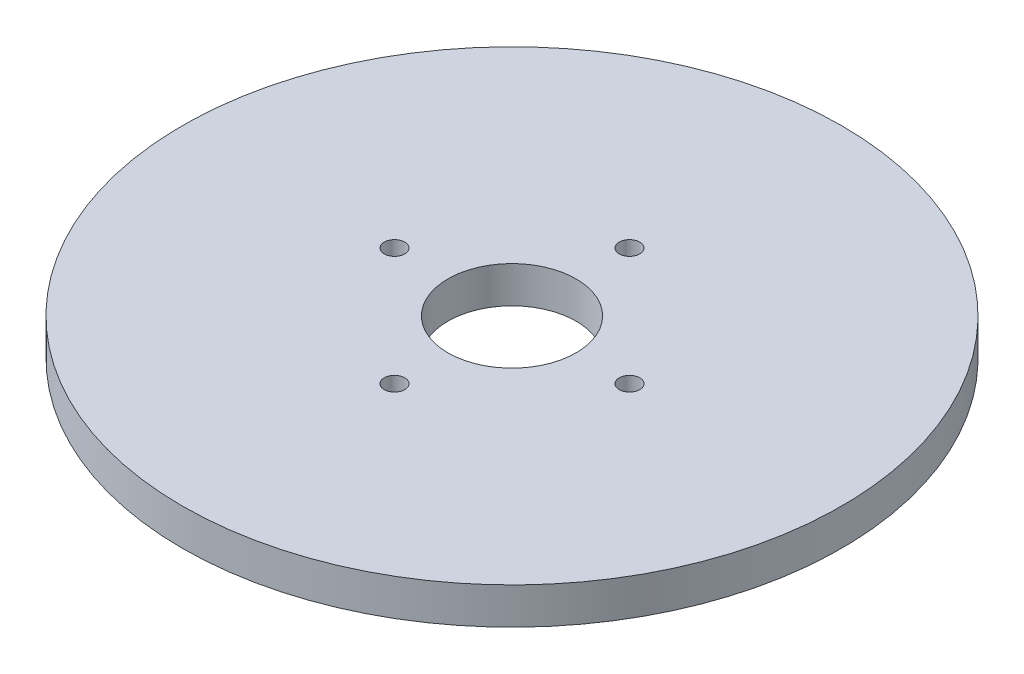
ISO-10303-21;
HEADER;
FILE_DESCRIPTION(('STEP AP214'),'2;1');
FILE_NAME('part.step','',(''),(''),'','','');
FILE_SCHEMA(('AUTOMOTIVE_DESIGN { 1 0 10303 214 1 1 1 1 }'));
ENDSEC;
DATA;
#1=APPLICATION_CONTEXT('core data for automotive mechanical design processes');
#2=APPLICATION_PROTOCOL_DEFINITION('international standard','automotive_design',2000,#1);
#3=PRODUCT_CONTEXT('',#1,'mechanical');
#4=PRODUCT('Part','Part','',(#3));
#5=PRODUCT_RELATED_PRODUCT_CATEGORY('part','',(#4));
#6=PRODUCT_DEFINITION_FORMATION('','',#4);
#7=PRODUCT_DEFINITION_CONTEXT('part definition',#1,'design');
#8=PRODUCT_DEFINITION('design','',#6,#7);
#9=PRODUCT_DEFINITION_SHAPE('','',#8);
#10=(LENGTH_UNIT() NAMED_UNIT(*) SI_UNIT(.MILLI.,.METRE.));
#11=(NAMED_UNIT(*) PLANE_ANGLE_UNIT() SI_UNIT($,.RADIAN.));
#12=(NAMED_UNIT(*) SI_UNIT($,.STERADIAN.) SOLID_ANGLE_UNIT());
#13=UNCERTAINTY_MEASURE_WITH_UNIT(LENGTH_MEASURE(1.E-05),#10,'distance_accuracy_value','');
#14=(GEOMETRIC_REPRESENTATION_CONTEXT(3) GLOBAL_UNCERTAINTY_ASSIGNED_CONTEXT((#13)) GLOBAL_UNIT_ASSIGNED_CONTEXT((#10,
#11,#12)) REPRESENTATION_CONTEXT('',''));
#15=CARTESIAN_POINT('',(0.,0.,0.));
#16=DIRECTION('',(0.,0.,1.));
#17=DIRECTION('',(1.,0.,0.));
#18=AXIS2_PLACEMENT_3D('',#15,#16,#17);
#19=CARTESIAN_POINT('',(0.,10.,0.));
#20=DIRECTION('',(0.,-1.,0.));
#21=DIRECTION('',(0.,0.,-1.));
#22=AXIS2_PLACEMENT_3D('',#19,#20,#21);
#23=CYLINDRICAL_SURFACE('',#22,90.);
#24=CARTESIAN_POINT('',(0.,10.,0.));
#25=DIRECTION('',(0.,1.,0.));
#26=DIRECTION('',(0.,0.,1.));
#27=AXIS2_PLACEMENT_3D('',#24,#25,#26);
#28=CIRCLE('',#27,90.);
#29=CARTESIAN_POINT('',(0.,10.,90.));
#30=VERTEX_POINT('',#29);
#31=EDGE_CURVE('E10',#30,#30,#28,.T.);
#32=ORIENTED_EDGE('',*,*,#31,.F.);
#33=EDGE_LOOP('',(#32));
#34=FACE_BOUND('',#33,.T.);
#35=CARTESIAN_POINT('',(0.,0.,0.));
#36=DIRECTION('',(0.,1.,0.));
#37=DIRECTION('',(0.,0.,1.));
#38=AXIS2_PLACEMENT_3D('',#35,#36,#37);
#39=CIRCLE('',#38,90.);
#40=CARTESIAN_POINT('',(0.,0.,90.));
#41=VERTEX_POINT('',#40);
#42=EDGE_CURVE('E37',#41,#41,#39,.T.);
#43=ORIENTED_EDGE('',*,*,#42,.T.);
#44=EDGE_LOOP('',(#43));
#45=FACE_BOUND('',#44,.T.);
#46=ADVANCED_FACE('F40',(#34,#45),#23,.T.);
#47=CARTESIAN_POINT('',(0.,10.,0.));
#48=DIRECTION('',(0.,1.,0.));
#49=DIRECTION('',(0.,0.,1.));
#50=AXIS2_PLACEMENT_3D('',#47,#48,#49);
#51=PLANE('',#50);
#52=CARTESIAN_POINT('',(1.12062470354495E-13,10.,32.0959671494695));
#53=DIRECTION('',(0.,1.,0.));
#54=DIRECTION('',(1.,0.,0.));
#55=AXIS2_PLACEMENT_3D('',#52,#53,#54);
#56=CIRCLE('',#55,2.80810623015521);
#57=CARTESIAN_POINT('',(1.12062470354495E-13,10.,34.9040733796247));
#58=VERTEX_POINT('',#57);
#59=EDGE_CURVE('E71',#58,#58,#56,.T.);
#60=ORIENTED_EDGE('',*,*,#59,.F.);
#61=EDGE_LOOP('',(#60));
#62=FACE_BOUND('',#61,.T.);
#63=CARTESIAN_POINT('',(32.0959671494695,10.,0.));
#64=DIRECTION('',(0.,1.,0.));
#65=DIRECTION('',(0.,0.,-1.));
#66=AXIS2_PLACEMENT_3D('',#63,#64,#65);
#67=CIRCLE('',#66,2.80810623015521);
#68=CARTESIAN_POINT('',(32.0959671494695,10.,2.80810623015521));
#69=VERTEX_POINT('',#68);
#70=EDGE_CURVE('E70',#69,#69,#67,.T.);
#71=ORIENTED_EDGE('',*,*,#70,.F.);
#72=EDGE_LOOP('',(#71));
#73=FACE_BOUND('',#72,.T.);
#74=CARTESIAN_POINT('',(-3.36187411063485E-13,10.,-32.0959671494695));
#75=DIRECTION('',(0.,1.,0.));
#76=DIRECTION('',(-1.,0.,0.));
#77=AXIS2_PLACEMENT_3D('',#74,#75,#76);
#78=CIRCLE('',#77,2.80810623015521);
#79=CARTESIAN_POINT('',(-3.36187411063485E-13,10.,-29.2878609193143));
#80=VERTEX_POINT('',#79);
#81=EDGE_CURVE('E61',#80,#80,#78,.T.);
#82=ORIENTED_EDGE('',*,*,#81,.F.);
#83=EDGE_LOOP('',(#82));
#84=FACE_BOUND('',#83,.T.);
#85=CARTESIAN_POINT('',(-32.0959671494695,10.,0.));
#86=DIRECTION('',(0.,1.,0.));
#87=DIRECTION('',(0.,0.,1.));
#88=AXIS2_PLACEMENT_3D('',#85,#86,#87);
#89=CIRCLE('',#88,2.80810623015521);
#90=CARTESIAN_POINT('',(-32.0959671494695,10.,2.80810623015521));
#91=VERTEX_POINT('',#90);
#92=EDGE_CURVE('E54',#91,#91,#89,.T.);
#93=ORIENTED_EDGE('',*,*,#92,.F.);
#94=EDGE_LOOP('',(#93));
#95=FACE_BOUND('',#94,.T.);
#96=CARTESIAN_POINT('',(0.,10.,0.));
#97=DIRECTION('',(0.,1.,0.));
#98=DIRECTION('',(0.,0.,1.));
#99=AXIS2_PLACEMENT_3D('',#96,#97,#98);
#100=CIRCLE('',#99,17.5);
#101=CARTESIAN_POINT('',(0.,10.,17.5));
#102=VERTEX_POINT('',#101);
#103=EDGE_CURVE('E50',#102,#102,#100,.T.);
#104=ORIENTED_EDGE('',*,*,#103,.F.);
#105=EDGE_LOOP('',(#104));
#106=FACE_BOUND('',#105,.T.);
#107=ORIENTED_EDGE('',*,*,#31,.T.);
#108=EDGE_LOOP('',(#107));
#109=FACE_BOUND('',#108,.T.);
#110=ADVANCED_FACE('F86',(#62,#73,#84,#95,#106,#109),#51,.T.);
#111=CARTESIAN_POINT('',(0.,0.,0.));
#112=DIRECTION('',(0.,1.,0.));
#113=DIRECTION('',(0.,0.,1.));
#114=AXIS2_PLACEMENT_3D('',#111,#112,#113);
#115=PLANE('',#114);
#116=CARTESIAN_POINT('',(0.,0.,0.));
#117=DIRECTION('',(0.,1.,0.));
#118=DIRECTION('',(0.,0.,1.));
#119=AXIS2_PLACEMENT_3D('',#116,#117,#118);
#120=CIRCLE('',#119,17.5);
#121=CARTESIAN_POINT('',(0.,0.,17.5));
#122=VERTEX_POINT('',#121);
#123=EDGE_CURVE('E47',#122,#122,#120,.T.);
#124=ORIENTED_EDGE('',*,*,#123,.T.);
#125=EDGE_LOOP('',(#124));
#126=FACE_BOUND('',#125,.T.);
#127=ORIENTED_EDGE('',*,*,#42,.F.);
#128=EDGE_LOOP('',(#127));
#129=FACE_BOUND('',#128,.T.);
#130=ADVANCED_FACE('F93',(#126,#129),#115,.F.);
#131=CARTESIAN_POINT('',(0.,10.,0.));
#132=DIRECTION('',(0.,-1.,0.));
#133=DIRECTION('',(0.,0.,-1.));
#134=AXIS2_PLACEMENT_3D('',#131,#132,#133);
#135=CYLINDRICAL_SURFACE('',#134,17.5);
#136=ORIENTED_EDGE('',*,*,#103,.T.);
#137=EDGE_LOOP('',(#136));
#138=FACE_BOUND('',#137,.T.);
#139=ORIENTED_EDGE('',*,*,#123,.F.);
#140=EDGE_LOOP('',(#139));
#141=FACE_BOUND('',#140,.T.);
#142=ADVANCED_FACE('F101',(#138,#141),#135,.F.);
#143=CARTESIAN_POINT('',(-32.0959671494695,3.94952458068707,0.));
#144=DIRECTION('',(0.,1.,0.));
#145=DIRECTION('',(0.,0.,1.));
#146=AXIS2_PLACEMENT_3D('',#143,#144,#145);
#147=CYLINDRICAL_SURFACE('',#146,2.80810623015521);
#148=CARTESIAN_POINT('',(-32.0959671494695,3.94952458068707,0.));
#149=DIRECTION('',(0.,1.,0.));
#150=DIRECTION('',(0.,0.,1.));
#151=AXIS2_PLACEMENT_3D('',#148,#149,#150);
#152=CIRCLE('',#151,2.80810623015521);
#153=CARTESIAN_POINT('',(-32.0959671494695,3.94952458068707,2.80810623015521));
#154=VERTEX_POINT('',#153);
#155=EDGE_CURVE('E55',#154,#154,#152,.T.);
#156=CARTESIAN_POINT('',(-32.0959671494695,3.94952458068707,2.80810623015521));
#157=CARTESIAN_POINT('',(-32.0959671494695,4.01255036630491,2.80810623015521));
#158=CARTESIAN_POINT('',(-32.0959671494695,4.07557615192276,2.80810623015521));
#159=CARTESIAN_POINT('',(-32.0959671494695,4.20162772315844,2.80810623015521));
#160=CARTESIAN_POINT('',(-32.0959671494695,4.26465350877629,2.80810623015521));
#161=CARTESIAN_POINT('',(-32.0959671494695,4.39070508001197,2.80810623015521));
#162=CARTESIAN_POINT('',(-32.0959671494695,4.45373086562982,2.80810623015521));
#163=CARTESIAN_POINT('',(-32.0959671494695,4.5797824368655,2.80810623015521));
#164=CARTESIAN_POINT('',(-32.0959671494695,4.64280822248334,2.80810623015521));
#165=CARTESIAN_POINT('',(-32.0959671494695,4.76885979371903,2.80810623015521));
#166=CARTESIAN_POINT('',(-32.0959671494695,4.83188557933687,2.80810623015521));
#167=CARTESIAN_POINT('',(-32.0959671494695,4.95793715057256,2.80810623015521));
#168=CARTESIAN_POINT('',(-32.0959671494695,5.0209629361904,2.80810623015521));
#169=CARTESIAN_POINT('',(-32.0959671494695,5.14701450742609,2.80810623015521));
#170=CARTESIAN_POINT('',(-32.0959671494695,5.21004029304393,2.80810623015521));
#171=CARTESIAN_POINT('',(-32.0959671494695,5.33609186427962,2.80810623015521));
#172=CARTESIAN_POINT('',(-32.0959671494695,5.39911764989746,2.80810623015521));
#173=CARTESIAN_POINT('',(-32.0959671494695,5.52516922113315,2.80810623015521));
#174=CARTESIAN_POINT('',(-32.0959671494695,5.58819500675099,2.80810623015521));
#175=CARTESIAN_POINT('',(-32.0959671494695,5.71424657798667,2.80810623015521));
#176=CARTESIAN_POINT('',(-32.0959671494695,5.77727236360452,2.80810623015521));
#177=CARTESIAN_POINT('',(-32.0959671494695,5.9033239348402,2.80810623015521));
#178=CARTESIAN_POINT('',(-32.0959671494695,5.96634972045805,2.80810623015521));
#179=CARTESIAN_POINT('',(-32.0959671494695,6.09240129169373,2.80810623015521));
#180=CARTESIAN_POINT('',(-32.0959671494695,6.15542707731158,2.80810623015521));
#181=CARTESIAN_POINT('',(-32.0959671494695,6.28147864854726,2.80810623015521));
#182=CARTESIAN_POINT('',(-32.0959671494695,6.34450443416511,2.80810623015521));
#183=CARTESIAN_POINT('',(-32.0959671494695,6.47055600540079,2.80810623015521));
#184=CARTESIAN_POINT('',(-32.0959671494695,6.53358179101863,2.80810623015521));
#185=CARTESIAN_POINT('',(-32.0959671494695,6.65963336225432,2.80810623015521));
#186=CARTESIAN_POINT('',(-32.0959671494695,6.72265914787216,2.80810623015521));
#187=CARTESIAN_POINT('',(-32.0959671494695,6.84871071910785,2.80810623015521));
#188=CARTESIAN_POINT('',(-32.0959671494695,6.91173650472569,2.80810623015521));
#189=CARTESIAN_POINT('',(-32.0959671494695,7.03778807596138,2.80810623015521));
#190=CARTESIAN_POINT('',(-32.0959671494695,7.10081386157922,2.80810623015521));
#191=CARTESIAN_POINT('',(-32.0959671494695,7.22686543281491,2.80810623015521));
#192=CARTESIAN_POINT('',(-32.0959671494695,7.28989121843275,2.80810623015521));
#193=CARTESIAN_POINT('',(-32.0959671494695,7.41594278966844,2.80810623015521));
#194=CARTESIAN_POINT('',(-32.0959671494695,7.47896857528628,2.80810623015521));
#195=CARTESIAN_POINT('',(-32.0959671494695,7.60502014652196,2.80810623015521));
#196=CARTESIAN_POINT('',(-32.0959671494695,7.66804593213981,2.80810623015521));
#197=CARTESIAN_POINT('',(-32.0959671494695,7.79409750337549,2.80810623015521));
#198=CARTESIAN_POINT('',(-32.0959671494695,7.85712328899334,2.80810623015521));
#199=CARTESIAN_POINT('',(-32.0959671494695,7.98317486022902,2.80810623015521));
#200=CARTESIAN_POINT('',(-32.0959671494695,8.04620064584687,2.80810623015521));
#201=CARTESIAN_POINT('',(-32.0959671494695,8.17225221708255,2.80810623015521));
#202=CARTESIAN_POINT('',(-32.0959671494695,8.2352780027004,2.80810623015521));
#203=CARTESIAN_POINT('',(-32.0959671494695,8.36132957393608,2.80810623015521));
#204=CARTESIAN_POINT('',(-32.0959671494695,8.42435535955392,2.80810623015521));
#205=CARTESIAN_POINT('',(-32.0959671494695,8.55040693078961,2.80810623015521));
#206=CARTESIAN_POINT('',(-32.0959671494695,8.61343271640746,2.80810623015521));
#207=CARTESIAN_POINT('',(-32.0959671494695,8.73948428764314,2.80810623015521));
#208=CARTESIAN_POINT('',(-32.0959671494695,8.80251007326098,2.80810623015521));
#209=CARTESIAN_POINT('',(-32.0959671494695,8.92856164449667,2.80810623015521));
#210=CARTESIAN_POINT('',(-32.0959671494695,8.99158743011451,2.80810623015521));
#211=CARTESIAN_POINT('',(-32.0959671494695,9.1176390013502,2.80810623015521));
#212=CARTESIAN_POINT('',(-32.0959671494695,9.18066478696804,2.80810623015521));
#213=CARTESIAN_POINT('',(-32.0959671494695,9.30671635820373,2.80810623015521));
#214=CARTESIAN_POINT('',(-32.0959671494695,9.36974214382157,2.80810623015521));
#215=CARTESIAN_POINT('',(-32.0959671494695,9.49579371505726,2.80810623015521));
#216=CARTESIAN_POINT('',(-32.0959671494695,9.5588195006751,2.80810623015521));
#217=CARTESIAN_POINT('',(-32.0959671494695,9.68487107191078,2.80810623015521));
#218=CARTESIAN_POINT('',(-32.0959671494695,9.74789685752863,2.80810623015521));
#219=CARTESIAN_POINT('',(-32.0959671494695,9.87394842876432,2.80810623015521));
#220=CARTESIAN_POINT('',(-32.0959671494695,9.93697421438216,2.80810623015521));
#221=CARTESIAN_POINT('',(-32.0959671494695,10.,2.80810623015521));
#222=B_SPLINE_CURVE_WITH_KNOTS('',3,(#156,#157,#158,#159,#160,#161,#162,#163,#164,#165,#166,
#167,#168,#169,#170,#171,#172,#173,#174,#175,#176,#177,#178,#179,#180,#181,#182,#183,#184,#185,
#186,#187,#188,#189,#190,#191,#192,#193,#194,#195,#196,#197,#198,#199,#200,#201,#202,#203,#204,
#205,#206,#207,#208,#209,#210,#211,#212,#213,#214,#215,#216,#217,#218,#219,#220,#221),
.UNSPECIFIED.,.F.,.F.,(4,2,2,2,2,2,2,2,2,2,2,2,2,2,2,2,2,2,2,2,2,2,2,2,2,2,2,2,2,2,2,2,4),(0.,
0.189077356853529,0.378154713707057,0.567232070560587,0.756309427414116,0.945386784267645,
1.13446414112117,1.3235414979747,1.51261885482823,1.70169621168176,1.89077356853529,
2.07985092538882,2.26892828224235,2.45800563909588,2.64708299594941,2.83616035280293,
3.02523770965646,3.21431506650999,3.40339242336352,3.59246978021705,3.78154713707058,
3.97062449392411,4.15970185077764,4.34877920763117,4.5378565644847,4.72693392133823,
4.91601127819176,5.10508863504528,5.29416599189881,5.48324334875234,5.67232070560587,
5.8613980624594,6.05047541931293),.UNSPECIFIED.);
#223=EDGE_CURVE('BSEAM102',#154,#91,#222,.T.);
#224=ORIENTED_EDGE('',*,*,#155,.F.);
#225=ORIENTED_EDGE('',*,*,#92,.T.);
#226=ORIENTED_EDGE('',*,*,#223,.T.);
#227=ORIENTED_EDGE('',*,*,#223,.F.);
#228=EDGE_LOOP('',(#224,#226,#225,#227));
#229=FACE_BOUND('',#228,.T.);
#230=ADVANCED_FACE('F102',(#229),#147,.F.);
#231=CARTESIAN_POINT('',(-32.0959671494695,3.94952458068707,0.));
#232=DIRECTION('',(0.,1.,0.));
#233=DIRECTION('',(0.,0.,1.));
#234=AXIS2_PLACEMENT_3D('',#231,#232,#233);
#235=PLANE('',#234);
#236=ORIENTED_EDGE('',*,*,#155,.T.);
#237=EDGE_LOOP('',(#236));
#238=FACE_BOUND('',#237,.T.);
#239=ADVANCED_FACE('F133',(#238),#235,.T.);
#240=CARTESIAN_POINT('',(-3.36187411063485E-13,3.94952458068707,-32.0959671494695));
#241=DIRECTION('',(0.,1.,0.));
#242=DIRECTION('',(0.,0.,1.));
#243=AXIS2_PLACEMENT_3D('',#240,#241,#242);
#244=CYLINDRICAL_SURFACE('',#243,2.80810623015521);
#245=CARTESIAN_POINT('',(-3.36187411063485E-13,3.94952458068707,-32.0959671494695));
#246=DIRECTION('',(0.,1.,0.));
#247=DIRECTION('',(-1.,0.,0.));
#248=AXIS2_PLACEMENT_3D('',#245,#246,#247);
#249=CIRCLE('',#248,2.80810623015521);
#250=CARTESIAN_POINT('',(-3.36187411063485E-13,3.94952458068707,-29.2878609193143));
#251=VERTEX_POINT('',#250);
#252=EDGE_CURVE('E63',#251,#251,#249,.T.);
#253=CARTESIAN_POINT('',(-3.36187411063485E-13,3.94952458068707,-29.2878609193143));
#254=CARTESIAN_POINT('',(-3.36187411063485E-13,4.01255036630491,-29.2878609193143));
#255=CARTESIAN_POINT('',(-3.36187411063485E-13,4.07557615192276,-29.2878609193143));
#256=CARTESIAN_POINT('',(-3.36187411063485E-13,4.20162772315844,-29.2878609193143));
#257=CARTESIAN_POINT('',(-3.36187411063485E-13,4.26465350877629,-29.2878609193143));
#258=CARTESIAN_POINT('',(-3.36187411063485E-13,4.39070508001197,-29.2878609193143));
#259=CARTESIAN_POINT('',(-3.36187411063485E-13,4.45373086562982,-29.2878609193143));
#260=CARTESIAN_POINT('',(-3.36187411063485E-13,4.5797824368655,-29.2878609193143));
#261=CARTESIAN_POINT('',(-3.36187411063485E-13,4.64280822248334,-29.2878609193143));
#262=CARTESIAN_POINT('',(-3.36187411063485E-13,4.76885979371903,-29.2878609193143));
#263=CARTESIAN_POINT('',(-3.36187411063485E-13,4.83188557933687,-29.2878609193143));
#264=CARTESIAN_POINT('',(-3.36187411063485E-13,4.95793715057256,-29.2878609193143));
#265=CARTESIAN_POINT('',(-3.36187411063485E-13,5.0209629361904,-29.2878609193143));
#266=CARTESIAN_POINT('',(-3.36187411063485E-13,5.14701450742609,-29.2878609193143));
#267=CARTESIAN_POINT('',(-3.36187411063485E-13,5.21004029304393,-29.2878609193143));
#268=CARTESIAN_POINT('',(-3.36187411063485E-13,5.33609186427962,-29.2878609193143));
#269=CARTESIAN_POINT('',(-3.36187411063485E-13,5.39911764989746,-29.2878609193143));
#270=CARTESIAN_POINT('',(-3.36187411063485E-13,5.52516922113315,-29.2878609193143));
#271=CARTESIAN_POINT('',(-3.36187411063485E-13,5.58819500675099,-29.2878609193143));
#272=CARTESIAN_POINT('',(-3.36187411063485E-13,5.71424657798667,-29.2878609193143));
#273=CARTESIAN_POINT('',(-3.36187411063485E-13,5.77727236360452,-29.2878609193143));
#274=CARTESIAN_POINT('',(-3.36187411063485E-13,5.9033239348402,-29.2878609193143));
#275=CARTESIAN_POINT('',(-3.36187411063485E-13,5.96634972045805,-29.2878609193143));
#276=CARTESIAN_POINT('',(-3.36187411063485E-13,6.09240129169373,-29.2878609193143));
#277=CARTESIAN_POINT('',(-3.36187411063485E-13,6.15542707731158,-29.2878609193143));
#278=CARTESIAN_POINT('',(-3.36187411063485E-13,6.28147864854726,-29.2878609193143));
#279=CARTESIAN_POINT('',(-3.36187411063485E-13,6.34450443416511,-29.2878609193143));
#280=CARTESIAN_POINT('',(-3.36187411063485E-13,6.47055600540079,-29.2878609193143));
#281=CARTESIAN_POINT('',(-3.36187411063485E-13,6.53358179101863,-29.2878609193143));
#282=CARTESIAN_POINT('',(-3.36187411063485E-13,6.65963336225432,-29.2878609193143));
#283=CARTESIAN_POINT('',(-3.36187411063485E-13,6.72265914787216,-29.2878609193143));
#284=CARTESIAN_POINT('',(-3.36187411063485E-13,6.84871071910785,-29.2878609193143));
#285=CARTESIAN_POINT('',(-3.36187411063485E-13,6.91173650472569,-29.2878609193143));
#286=CARTESIAN_POINT('',(-3.36187411063485E-13,7.03778807596138,-29.2878609193143));
#287=CARTESIAN_POINT('',(-3.36187411063485E-13,7.10081386157922,-29.2878609193143));
#288=CARTESIAN_POINT('',(-3.36187411063485E-13,7.22686543281491,-29.2878609193143));
#289=CARTESIAN_POINT('',(-3.36187411063485E-13,7.28989121843275,-29.2878609193143));
#290=CARTESIAN_POINT('',(-3.36187411063485E-13,7.41594278966844,-29.2878609193143));
#291=CARTESIAN_POINT('',(-3.36187411063485E-13,7.47896857528628,-29.2878609193143));
#292=CARTESIAN_POINT('',(-3.36187411063485E-13,7.60502014652196,-29.2878609193143));
#293=CARTESIAN_POINT('',(-3.36187411063485E-13,7.66804593213981,-29.2878609193143));
#294=CARTESIAN_POINT('',(-3.36187411063485E-13,7.79409750337549,-29.2878609193143));
#295=CARTESIAN_POINT('',(-3.36187411063485E-13,7.85712328899334,-29.2878609193143));
#296=CARTESIAN_POINT('',(-3.36187411063485E-13,7.98317486022902,-29.2878609193143));
#297=CARTESIAN_POINT('',(-3.36187411063485E-13,8.04620064584687,-29.2878609193143));
#298=CARTESIAN_POINT('',(-3.36187411063485E-13,8.17225221708255,-29.2878609193143));
#299=CARTESIAN_POINT('',(-3.36187411063485E-13,8.2352780027004,-29.2878609193143));
#300=CARTESIAN_POINT('',(-3.36187411063485E-13,8.36132957393608,-29.2878609193143));
#301=CARTESIAN_POINT('',(-3.36187411063485E-13,8.42435535955392,-29.2878609193143));
#302=CARTESIAN_POINT('',(-3.36187411063485E-13,8.55040693078961,-29.2878609193143));
#303=CARTESIAN_POINT('',(-3.36187411063485E-13,8.61343271640746,-29.2878609193143));
#304=CARTESIAN_POINT('',(-3.36187411063485E-13,8.73948428764314,-29.2878609193143));
#305=CARTESIAN_POINT('',(-3.36187411063485E-13,8.80251007326098,-29.2878609193143));
#306=CARTESIAN_POINT('',(-3.36187411063485E-13,8.92856164449667,-29.2878609193143));
#307=CARTESIAN_POINT('',(-3.36187411063485E-13,8.99158743011451,-29.2878609193143));
#308=CARTESIAN_POINT('',(-3.36187411063485E-13,9.1176390013502,-29.2878609193143));
#309=CARTESIAN_POINT('',(-3.36187411063485E-13,9.18066478696804,-29.2878609193143));
#310=CARTESIAN_POINT('',(-3.36187411063485E-13,9.30671635820373,-29.2878609193143));
#311=CARTESIAN_POINT('',(-3.36187411063485E-13,9.36974214382157,-29.2878609193143));
#312=CARTESIAN_POINT('',(-3.36187411063485E-13,9.49579371505726,-29.2878609193143));
#313=CARTESIAN_POINT('',(-3.36187411063485E-13,9.5588195006751,-29.2878609193143));
#314=CARTESIAN_POINT('',(-3.36187411063485E-13,9.68487107191078,-29.2878609193143));
#315=CARTESIAN_POINT('',(-3.36187411063485E-13,9.74789685752863,-29.2878609193143));
#316=CARTESIAN_POINT('',(-3.36187411063485E-13,9.87394842876432,-29.2878609193143));
#317=CARTESIAN_POINT('',(-3.36187411063485E-13,9.93697421438216,-29.2878609193143));
#318=CARTESIAN_POINT('',(-3.36187411063485E-13,10.,-29.2878609193143));
#319=B_SPLINE_CURVE_WITH_KNOTS('',3,(#253,#254,#255,#256,#257,#258,#259,#260,#261,#262,#263,
#264,#265,#266,#267,#268,#269,#270,#271,#272,#273,#274,#275,#276,#277,#278,#279,#280,#281,#282,
#283,#284,#285,#286,#287,#288,#289,#290,#291,#292,#293,#294,#295,#296,#297,#298,#299,#300,#301,
#302,#303,#304,#305,#306,#307,#308,#309,#310,#311,#312,#313,#314,#315,#316,#317,#318),
.UNSPECIFIED.,.F.,.F.,(4,2,2,2,2,2,2,2,2,2,2,2,2,2,2,2,2,2,2,2,2,2,2,2,2,2,2,2,2,2,2,2,4),(0.,
0.189077356853529,0.378154713707057,0.567232070560587,0.756309427414116,0.945386784267645,
1.13446414112117,1.3235414979747,1.51261885482823,1.70169621168176,1.89077356853529,
2.07985092538882,2.26892828224235,2.45800563909588,2.64708299594941,2.83616035280293,
3.02523770965646,3.21431506650999,3.40339242336352,3.59246978021705,3.78154713707058,
3.97062449392411,4.15970185077764,4.34877920763117,4.5378565644847,4.72693392133823,
4.91601127819176,5.10508863504528,5.29416599189881,5.48324334875234,5.67232070560587,
5.8613980624594,6.05047541931293),.UNSPECIFIED.);
#320=EDGE_CURVE('BSEAM142',#251,#80,#319,.T.);
#321=ORIENTED_EDGE('',*,*,#252,.F.);
#322=ORIENTED_EDGE('',*,*,#81,.T.);
#323=ORIENTED_EDGE('',*,*,#320,.T.);
#324=ORIENTED_EDGE('',*,*,#320,.F.);
#325=EDGE_LOOP('',(#321,#323,#322,#324));
#326=FACE_BOUND('',#325,.T.);
#327=ADVANCED_FACE('F142',(#326),#244,.F.);
#328=CARTESIAN_POINT('',(-3.36187411063485E-13,3.94952458068707,-32.0959671494695));
#329=DIRECTION('',(0.,1.,0.));
#330=DIRECTION('',(-1.,0.,0.));
#331=AXIS2_PLACEMENT_3D('',#328,#329,#330);
#332=PLANE('',#331);
#333=ORIENTED_EDGE('',*,*,#252,.T.);
#334=EDGE_LOOP('',(#333));
#335=FACE_BOUND('',#334,.T.);
#336=ADVANCED_FACE('F156',(#335),#332,.T.);
#337=CARTESIAN_POINT('',(32.0959671494695,3.94952458068707,0.));
#338=DIRECTION('',(0.,1.,0.));
#339=DIRECTION('',(0.,0.,1.));
#340=AXIS2_PLACEMENT_3D('',#337,#338,#339);
#341=CYLINDRICAL_SURFACE('',#340,2.80810623015521);
#342=CARTESIAN_POINT('',(32.0959671494695,3.94952458068707,0.));
#343=DIRECTION('',(0.,1.,0.));
#344=DIRECTION('',(0.,0.,-1.));
#345=AXIS2_PLACEMENT_3D('',#342,#343,#344);
#346=CIRCLE('',#345,2.80810623015521);
#347=CARTESIAN_POINT('',(32.0959671494695,3.94952458068707,2.80810623015521));
#348=VERTEX_POINT('',#347);
#349=EDGE_CURVE('E69',#348,#348,#346,.T.);
#350=CARTESIAN_POINT('',(32.0959671494695,3.94952458068707,2.80810623015521));
#351=CARTESIAN_POINT('',(32.0959671494695,4.01255036630491,2.80810623015521));
#352=CARTESIAN_POINT('',(32.0959671494695,4.07557615192276,2.80810623015521));
#353=CARTESIAN_POINT('',(32.0959671494695,4.20162772315844,2.80810623015521));
#354=CARTESIAN_POINT('',(32.0959671494695,4.26465350877629,2.80810623015521));
#355=CARTESIAN_POINT('',(32.0959671494695,4.39070508001197,2.80810623015521));
#356=CARTESIAN_POINT('',(32.0959671494695,4.45373086562982,2.80810623015521));
#357=CARTESIAN_POINT('',(32.0959671494695,4.5797824368655,2.80810623015521));
#358=CARTESIAN_POINT('',(32.0959671494695,4.64280822248334,2.80810623015521));
#359=CARTESIAN_POINT('',(32.0959671494695,4.76885979371903,2.80810623015521));
#360=CARTESIAN_POINT('',(32.0959671494695,4.83188557933687,2.80810623015521));
#361=CARTESIAN_POINT('',(32.0959671494695,4.95793715057256,2.80810623015521));
#362=CARTESIAN_POINT('',(32.0959671494695,5.0209629361904,2.80810623015521));
#363=CARTESIAN_POINT('',(32.0959671494695,5.14701450742609,2.80810623015521));
#364=CARTESIAN_POINT('',(32.0959671494695,5.21004029304393,2.80810623015521));
#365=CARTESIAN_POINT('',(32.0959671494695,5.33609186427962,2.80810623015521));
#366=CARTESIAN_POINT('',(32.0959671494695,5.39911764989746,2.80810623015521));
#367=CARTESIAN_POINT('',(32.0959671494695,5.52516922113315,2.80810623015521));
#368=CARTESIAN_POINT('',(32.0959671494695,5.58819500675099,2.80810623015521));
#369=CARTESIAN_POINT('',(32.0959671494695,5.71424657798667,2.80810623015521));
#370=CARTESIAN_POINT('',(32.0959671494695,5.77727236360452,2.80810623015521));
#371=CARTESIAN_POINT('',(32.0959671494695,5.9033239348402,2.80810623015521));
#372=CARTESIAN_POINT('',(32.0959671494695,5.96634972045805,2.80810623015521));
#373=CARTESIAN_POINT('',(32.0959671494695,6.09240129169373,2.80810623015521));
#374=CARTESIAN_POINT('',(32.0959671494695,6.15542707731158,2.80810623015521));
#375=CARTESIAN_POINT('',(32.0959671494695,6.28147864854726,2.80810623015521));
#376=CARTESIAN_POINT('',(32.0959671494695,6.34450443416511,2.80810623015521));
#377=CARTESIAN_POINT('',(32.0959671494695,6.47055600540079,2.80810623015521));
#378=CARTESIAN_POINT('',(32.0959671494695,6.53358179101863,2.80810623015521));
#379=CARTESIAN_POINT('',(32.0959671494695,6.65963336225432,2.80810623015521));
#380=CARTESIAN_POINT('',(32.0959671494695,6.72265914787216,2.80810623015521));
#381=CARTESIAN_POINT('',(32.0959671494695,6.84871071910785,2.80810623015521));
#382=CARTESIAN_POINT('',(32.0959671494695,6.91173650472569,2.80810623015521));
#383=CARTESIAN_POINT('',(32.0959671494695,7.03778807596138,2.80810623015521));
#384=CARTESIAN_POINT('',(32.0959671494695,7.10081386157922,2.80810623015521));
#385=CARTESIAN_POINT('',(32.0959671494695,7.22686543281491,2.80810623015521));
#386=CARTESIAN_POINT('',(32.0959671494695,7.28989121843275,2.80810623015521));
#387=CARTESIAN_POINT('',(32.0959671494695,7.41594278966844,2.80810623015521));
#388=CARTESIAN_POINT('',(32.0959671494695,7.47896857528628,2.80810623015521));
#389=CARTESIAN_POINT('',(32.0959671494695,7.60502014652196,2.80810623015521));
#390=CARTESIAN_POINT('',(32.0959671494695,7.66804593213981,2.80810623015521));
#391=CARTESIAN_POINT('',(32.0959671494695,7.79409750337549,2.80810623015521));
#392=CARTESIAN_POINT('',(32.0959671494695,7.85712328899334,2.80810623015521));
#393=CARTESIAN_POINT('',(32.0959671494695,7.98317486022902,2.80810623015521));
#394=CARTESIAN_POINT('',(32.0959671494695,8.04620064584687,2.80810623015521));
#395=CARTESIAN_POINT('',(32.0959671494695,8.17225221708255,2.80810623015521));
#396=CARTESIAN_POINT('',(32.0959671494695,8.2352780027004,2.80810623015521));
#397=CARTESIAN_POINT('',(32.0959671494695,8.36132957393608,2.80810623015521));
#398=CARTESIAN_POINT('',(32.0959671494695,8.42435535955392,2.80810623015521));
#399=CARTESIAN_POINT('',(32.0959671494695,8.55040693078961,2.80810623015521));
#400=CARTESIAN_POINT('',(32.0959671494695,8.61343271640746,2.80810623015521));
#401=CARTESIAN_POINT('',(32.0959671494695,8.73948428764314,2.80810623015521));
#402=CARTESIAN_POINT('',(32.0959671494695,8.80251007326098,2.80810623015521));
#403=CARTESIAN_POINT('',(32.0959671494695,8.92856164449667,2.80810623015521));
#404=CARTESIAN_POINT('',(32.0959671494695,8.99158743011451,2.80810623015521));
#405=CARTESIAN_POINT('',(32.0959671494695,9.1176390013502,2.80810623015521));
#406=CARTESIAN_POINT('',(32.0959671494695,9.18066478696804,2.80810623015521));
#407=CARTESIAN_POINT('',(32.0959671494695,9.30671635820373,2.80810623015521));
#408=CARTESIAN_POINT('',(32.0959671494695,9.36974214382157,2.80810623015521));
#409=CARTESIAN_POINT('',(32.0959671494695,9.49579371505726,2.80810623015521));
#410=CARTESIAN_POINT('',(32.0959671494695,9.5588195006751,2.80810623015521));
#411=CARTESIAN_POINT('',(32.0959671494695,9.68487107191078,2.80810623015521));
#412=CARTESIAN_POINT('',(32.0959671494695,9.74789685752863,2.80810623015521));
#413=CARTESIAN_POINT('',(32.0959671494695,9.87394842876432,2.80810623015521));
#414=CARTESIAN_POINT('',(32.0959671494695,9.93697421438216,2.80810623015521));
#415=CARTESIAN_POINT('',(32.0959671494695,10.,2.80810623015521));
#416=B_SPLINE_CURVE_WITH_KNOTS('',3,(#350,#351,#352,#353,#354,#355,#356,#357,#358,#359,#360,
#361,#362,#363,#364,#365,#366,#367,#368,#369,#370,#371,#372,#373,#374,#375,#376,#377,#378,#379,
#380,#381,#382,#383,#384,#385,#386,#387,#388,#389,#390,#391,#392,#393,#394,#395,#396,#397,#398,
#399,#400,#401,#402,#403,#404,#405,#406,#407,#408,#409,#410,#411,#412,#413,#414,#415),
.UNSPECIFIED.,.F.,.F.,(4,2,2,2,2,2,2,2,2,2,2,2,2,2,2,2,2,2,2,2,2,2,2,2,2,2,2,2,2,2,2,2,4),(0.,
0.189077356853529,0.378154713707057,0.567232070560587,0.756309427414116,0.945386784267645,
1.13446414112117,1.3235414979747,1.51261885482823,1.70169621168176,1.89077356853529,
2.07985092538882,2.26892828224235,2.45800563909588,2.64708299594941,2.83616035280293,
3.02523770965646,3.21431506650999,3.40339242336352,3.59246978021705,3.78154713707058,
3.97062449392411,4.15970185077764,4.34877920763117,4.5378565644847,4.72693392133823,
4.91601127819176,5.10508863504528,5.29416599189881,5.48324334875234,5.67232070560587,
5.8613980624594,6.05047541931293),.UNSPECIFIED.);
#417=EDGE_CURVE('BSEAM164',#348,#69,#416,.T.);
#418=ORIENTED_EDGE('',*,*,#349,.F.);
#419=ORIENTED_EDGE('',*,*,#70,.T.);
#420=ORIENTED_EDGE('',*,*,#417,.T.);
#421=ORIENTED_EDGE('',*,*,#417,.F.);
#422=EDGE_LOOP('',(#418,#420,#419,#421));
#423=FACE_BOUND('',#422,.T.);
#424=ADVANCED_FACE('F164',(#423),#341,.F.);
#425=CARTESIAN_POINT('',(32.0959671494695,3.94952458068707,0.));
#426=DIRECTION('',(0.,1.,0.));
#427=DIRECTION('',(0.,0.,-1.));
#428=AXIS2_PLACEMENT_3D('',#425,#426,#427);
#429=PLANE('',#428);
#430=ORIENTED_EDGE('',*,*,#349,.T.);
#431=EDGE_LOOP('',(#430));
#432=FACE_BOUND('',#431,.T.);
#433=ADVANCED_FACE('F83',(#432),#429,.T.);
#434=CARTESIAN_POINT('',(1.12062470354495E-13,3.94952458068707,32.0959671494695));
#435=DIRECTION('',(0.,1.,0.));
#436=DIRECTION('',(0.,0.,1.));
#437=AXIS2_PLACEMENT_3D('',#434,#435,#436);
#438=CYLINDRICAL_SURFACE('',#437,2.80810623015521);
#439=CARTESIAN_POINT('',(1.12062470354495E-13,3.94952458068707,32.0959671494695));
#440=DIRECTION('',(0.,1.,0.));
#441=DIRECTION('',(1.,0.,0.));
#442=AXIS2_PLACEMENT_3D('',#439,#440,#441);
#443=CIRCLE('',#442,2.80810623015521);
#444=CARTESIAN_POINT('',(1.12062470354495E-13,3.94952458068707,34.9040733796247));
#445=VERTEX_POINT('',#444);
#446=EDGE_CURVE('E59',#445,#445,#443,.T.);
#447=CARTESIAN_POINT('',(1.12062470354495E-13,3.94952458068707,34.9040733796247));
#448=CARTESIAN_POINT('',(1.12062470354495E-13,4.01255036630491,34.9040733796247));
#449=CARTESIAN_POINT('',(1.12062470354495E-13,4.07557615192276,34.9040733796247));
#450=CARTESIAN_POINT('',(1.12062470354495E-13,4.20162772315844,34.9040733796247));
#451=CARTESIAN_POINT('',(1.12062470354495E-13,4.26465350877629,34.9040733796247));
#452=CARTESIAN_POINT('',(1.12062470354495E-13,4.39070508001197,34.9040733796247));
#453=CARTESIAN_POINT('',(1.12062470354495E-13,4.45373086562982,34.9040733796247));
#454=CARTESIAN_POINT('',(1.12062470354495E-13,4.5797824368655,34.9040733796247));
#455=CARTESIAN_POINT('',(1.12062470354495E-13,4.64280822248334,34.9040733796247));
#456=CARTESIAN_POINT('',(1.12062470354495E-13,4.76885979371903,34.9040733796247));
#457=CARTESIAN_POINT('',(1.12062470354495E-13,4.83188557933687,34.9040733796247));
#458=CARTESIAN_POINT('',(1.12062470354495E-13,4.95793715057256,34.9040733796247));
#459=CARTESIAN_POINT('',(1.12062470354495E-13,5.0209629361904,34.9040733796247));
#460=CARTESIAN_POINT('',(1.12062470354495E-13,5.14701450742609,34.9040733796247));
#461=CARTESIAN_POINT('',(1.12062470354495E-13,5.21004029304393,34.9040733796247));
#462=CARTESIAN_POINT('',(1.12062470354495E-13,5.33609186427962,34.9040733796247));
#463=CARTESIAN_POINT('',(1.12062470354495E-13,5.39911764989746,34.9040733796247));
#464=CARTESIAN_POINT('',(1.12062470354495E-13,5.52516922113315,34.9040733796247));
#465=CARTESIAN_POINT('',(1.12062470354495E-13,5.58819500675099,34.9040733796247));
#466=CARTESIAN_POINT('',(1.12062470354495E-13,5.71424657798667,34.9040733796247));
#467=CARTESIAN_POINT('',(1.12062470354495E-13,5.77727236360452,34.9040733796247));
#468=CARTESIAN_POINT('',(1.12062470354495E-13,5.9033239348402,34.9040733796247));
#469=CARTESIAN_POINT('',(1.12062470354495E-13,5.96634972045805,34.9040733796247));
#470=CARTESIAN_POINT('',(1.12062470354495E-13,6.09240129169373,34.9040733796247));
#471=CARTESIAN_POINT('',(1.12062470354495E-13,6.15542707731158,34.9040733796247));
#472=CARTESIAN_POINT('',(1.12062470354495E-13,6.28147864854726,34.9040733796247));
#473=CARTESIAN_POINT('',(1.12062470354495E-13,6.34450443416511,34.9040733796247));
#474=CARTESIAN_POINT('',(1.12062470354495E-13,6.47055600540079,34.9040733796247));
#475=CARTESIAN_POINT('',(1.12062470354495E-13,6.53358179101863,34.9040733796247));
#476=CARTESIAN_POINT('',(1.12062470354495E-13,6.65963336225432,34.9040733796247));
#477=CARTESIAN_POINT('',(1.12062470354495E-13,6.72265914787216,34.9040733796247));
#478=CARTESIAN_POINT('',(1.12062470354495E-13,6.84871071910785,34.9040733796247));
#479=CARTESIAN_POINT('',(1.12062470354495E-13,6.91173650472569,34.9040733796247));
#480=CARTESIAN_POINT('',(1.12062470354495E-13,7.03778807596138,34.9040733796247));
#481=CARTESIAN_POINT('',(1.12062470354495E-13,7.10081386157922,34.9040733796247));
#482=CARTESIAN_POINT('',(1.12062470354495E-13,7.22686543281491,34.9040733796247));
#483=CARTESIAN_POINT('',(1.12062470354495E-13,7.28989121843275,34.9040733796247));
#484=CARTESIAN_POINT('',(1.12062470354495E-13,7.41594278966844,34.9040733796247));
#485=CARTESIAN_POINT('',(1.12062470354495E-13,7.47896857528628,34.9040733796247));
#486=CARTESIAN_POINT('',(1.12062470354495E-13,7.60502014652196,34.9040733796247));
#487=CARTESIAN_POINT('',(1.12062470354495E-13,7.66804593213981,34.9040733796247));
#488=CARTESIAN_POINT('',(1.12062470354495E-13,7.79409750337549,34.9040733796247));
#489=CARTESIAN_POINT('',(1.12062470354495E-13,7.85712328899334,34.9040733796247));
#490=CARTESIAN_POINT('',(1.12062470354495E-13,7.98317486022902,34.9040733796247));
#491=CARTESIAN_POINT('',(1.12062470354495E-13,8.04620064584687,34.9040733796247));
#492=CARTESIAN_POINT('',(1.12062470354495E-13,8.17225221708255,34.9040733796247));
#493=CARTESIAN_POINT('',(1.12062470354495E-13,8.2352780027004,34.9040733796247));
#494=CARTESIAN_POINT('',(1.12062470354495E-13,8.36132957393608,34.9040733796247));
#495=CARTESIAN_POINT('',(1.12062470354495E-13,8.42435535955392,34.9040733796247));
#496=CARTESIAN_POINT('',(1.12062470354495E-13,8.55040693078961,34.9040733796247));
#497=CARTESIAN_POINT('',(1.12062470354495E-13,8.61343271640746,34.9040733796247));
#498=CARTESIAN_POINT('',(1.12062470354495E-13,8.73948428764314,34.9040733796247));
#499=CARTESIAN_POINT('',(1.12062470354495E-13,8.80251007326098,34.9040733796247));
#500=CARTESIAN_POINT('',(1.12062470354495E-13,8.92856164449667,34.9040733796247));
#501=CARTESIAN_POINT('',(1.12062470354495E-13,8.99158743011451,34.9040733796247));
#502=CARTESIAN_POINT('',(1.12062470354495E-13,9.1176390013502,34.9040733796247));
#503=CARTESIAN_POINT('',(1.12062470354495E-13,9.18066478696804,34.9040733796247));
#504=CARTESIAN_POINT('',(1.12062470354495E-13,9.30671635820373,34.9040733796247));
#505=CARTESIAN_POINT('',(1.12062470354495E-13,9.36974214382157,34.9040733796247));
#506=CARTESIAN_POINT('',(1.12062470354495E-13,9.49579371505726,34.9040733796247));
#507=CARTESIAN_POINT('',(1.12062470354495E-13,9.5588195006751,34.9040733796247));
#508=CARTESIAN_POINT('',(1.12062470354495E-13,9.68487107191078,34.9040733796247));
#509=CARTESIAN_POINT('',(1.12062470354495E-13,9.74789685752863,34.9040733796247));
#510=CARTESIAN_POINT('',(1.12062470354495E-13,9.87394842876432,34.9040733796247));
#511=CARTESIAN_POINT('',(1.12062470354495E-13,9.93697421438216,34.9040733796247));
#512=CARTESIAN_POINT('',(1.12062470354495E-13,10.,34.9040733796247));
#513=B_SPLINE_CURVE_WITH_KNOTS('',3,(#447,#448,#449,#450,#451,#452,#453,#454,#455,#456,#457,
#458,#459,#460,#461,#462,#463,#464,#465,#466,#467,#468,#469,#470,#471,#472,#473,#474,#475,#476,
#477,#478,#479,#480,#481,#482,#483,#484,#485,#486,#487,#488,#489,#490,#491,#492,#493,#494,#495,
#496,#497,#498,#499,#500,#501,#502,#503,#504,#505,#506,#507,#508,#509,#510,#511,#512),
.UNSPECIFIED.,.F.,.F.,(4,2,2,2,2,2,2,2,2,2,2,2,2,2,2,2,2,2,2,2,2,2,2,2,2,2,2,2,2,2,2,2,4),(0.,
0.189077356853529,0.378154713707057,0.567232070560587,0.756309427414116,0.945386784267645,
1.13446414112117,1.3235414979747,1.51261885482823,1.70169621168176,1.89077356853529,
2.07985092538882,2.26892828224235,2.45800563909588,2.64708299594941,2.83616035280293,
3.02523770965646,3.21431506650999,3.40339242336352,3.59246978021705,3.78154713707058,
3.97062449392411,4.15970185077764,4.34877920763117,4.5378565644847,4.72693392133823,
4.91601127819176,5.10508863504528,5.29416599189881,5.48324334875234,5.67232070560587,
5.8613980624594,6.05047541931293),.UNSPECIFIED.);
#514=EDGE_CURVE('BSEAM81',#445,#58,#513,.T.);
#515=ORIENTED_EDGE('',*,*,#446,.F.);
#516=ORIENTED_EDGE('',*,*,#59,.T.);
#517=ORIENTED_EDGE('',*,*,#514,.T.);
#518=ORIENTED_EDGE('',*,*,#514,.F.);
#519=EDGE_LOOP('',(#515,#517,#516,#518));
#520=FACE_BOUND('',#519,.T.);
#521=ADVANCED_FACE('F81',(#520),#438,.F.);
#522=CARTESIAN_POINT('',(1.12062470354495E-13,3.94952458068707,32.0959671494695));
#523=DIRECTION('',(0.,1.,0.));
#524=DIRECTION('',(1.,0.,0.));
#525=AXIS2_PLACEMENT_3D('',#522,#523,#524);
#526=PLANE('',#525);
#527=ORIENTED_EDGE('',*,*,#446,.T.);
#528=EDGE_LOOP('',(#527));
#529=FACE_BOUND('',#528,.T.);
#530=ADVANCED_FACE('F78',(#529),#526,.T.);
#531=CLOSED_SHELL('',(#46,#110,#130,#142,#230,#239,#327,#336,#424,#433,#521,#530));
#532=MANIFOLD_SOLID_BREP('B2',#531);
#533=ADVANCED_BREP_SHAPE_REPRESENTATION('',(#18,#532),#14);
#534=SHAPE_DEFINITION_REPRESENTATION(#9,#533);
ENDSEC;
END-ISO-10303-21;
